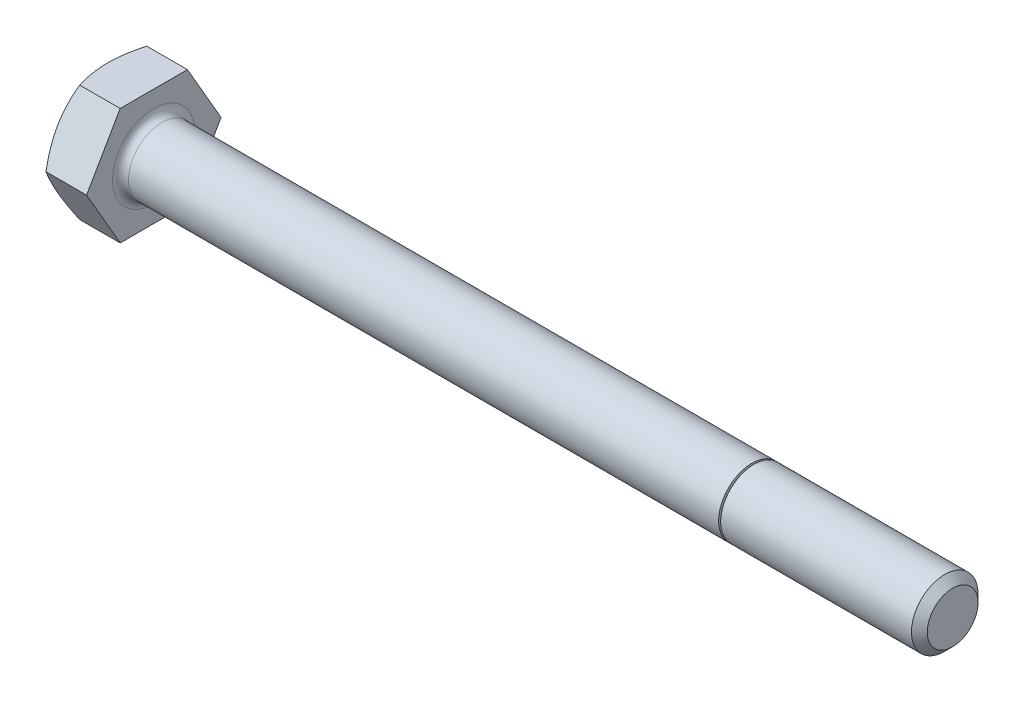
ISO-10303-21;
HEADER;
FILE_DESCRIPTION(('STEP AP214'),'2;1');
FILE_NAME('part.step','',(''),(''),'','','');
FILE_SCHEMA(('AUTOMOTIVE_DESIGN { 1 0 10303 214 1 1 1 1 }'));
ENDSEC;
DATA;
#1=APPLICATION_CONTEXT('core data for automotive mechanical design processes');
#2=APPLICATION_PROTOCOL_DEFINITION('international standard','automotive_design',2000,#1);
#3=PRODUCT_CONTEXT('',#1,'mechanical');
#4=PRODUCT('Part','Part','',(#3));
#5=PRODUCT_RELATED_PRODUCT_CATEGORY('part','',(#4));
#6=PRODUCT_DEFINITION_FORMATION('','',#4);
#7=PRODUCT_DEFINITION_CONTEXT('part definition',#1,'design');
#8=PRODUCT_DEFINITION('design','',#6,#7);
#9=PRODUCT_DEFINITION_SHAPE('','',#8);
#10=(LENGTH_UNIT() NAMED_UNIT(*) SI_UNIT(.MILLI.,.METRE.));
#11=(NAMED_UNIT(*) PLANE_ANGLE_UNIT() SI_UNIT($,.RADIAN.));
#12=(NAMED_UNIT(*) SI_UNIT($,.STERADIAN.) SOLID_ANGLE_UNIT());
#13=UNCERTAINTY_MEASURE_WITH_UNIT(LENGTH_MEASURE(1.E-05),#10,'distance_accuracy_value','');
#14=(GEOMETRIC_REPRESENTATION_CONTEXT(3) GLOBAL_UNCERTAINTY_ASSIGNED_CONTEXT((#13)) GLOBAL_UNIT_ASSIGNED_CONTEXT((#10,
#11,#12)) REPRESENTATION_CONTEXT('',''));
#15=CARTESIAN_POINT('',(0.,0.,0.));
#16=DIRECTION('',(0.,0.,1.));
#17=DIRECTION('',(1.,0.,0.));
#18=AXIS2_PLACEMENT_3D('',#15,#16,#17);
#19=CARTESIAN_POINT('',(-2.1828125,2.778125,-4.81185364977728));
#20=DIRECTION('',(0.,0.500000000000001,-0.866025403784438));
#21=DIRECTION('',(0.,0.866025403784438,0.500000000000001));
#22=AXIS2_PLACEMENT_3D('',#19,#20,#21);
#23=PLANE('',#22);
#24=CARTESIAN_POINT('',(-4.36562500004771,2.77812499999461,-4.81185364976793));
#25=CARTESIAN_POINT('',(-4.36564770823841,2.89604082120703,-4.74377491865721));
#26=CARTESIAN_POINT('',(-4.36273598289476,3.01395096201246,-4.67569946712628));
#27=CARTESIAN_POINT('',(-4.3512124439789,3.24953972538615,-4.53968223117683));
#28=CARTESIAN_POINT('',(-4.34260175884417,3.36721838916294,-4.47174042296655));
#29=CARTESIAN_POINT('',(-4.3199057801546,3.60158408770528,-4.33642932382367));
#30=CARTESIAN_POINT('',(-4.30584804700284,3.71827313957555,-4.26905886831512));
#31=CARTESIAN_POINT('',(-4.27256035949702,3.95109529630589,-4.13463893345372));
#32=CARTESIAN_POINT('',(-4.2533302690026,4.06722838645074,-4.06758946259672));
#33=CARTESIAN_POINT('',(-4.18847552960981,4.4143123329907,-3.86720045263038));
#34=CARTESIAN_POINT('',(-4.1356549211625,4.64425489751612,-3.7344430511035));
#35=CARTESIAN_POINT('',(-4.01383708794973,5.10216262148669,-3.47006990340515));
#36=CARTESIAN_POINT('',(-3.94475907436848,5.33011180869747,-3.33846337880748));
#37=CARTESIAN_POINT('',(-3.86936076655585,5.55625000000819,-3.20790243318012));
#38=B_SPLINE_CURVE_WITH_KNOTS('',3,(#24,#25,#26,#27,#28,#29,#30,#31,#32,#33,#34,#35,#36,#37),
.UNSPECIFIED.,.F.,.F.,(4,2,2,2,2,2,4),(0.,0.40843070134794,0.816780554488554,1.22309070766075,
1.62941155627177,2.44098829515902,3.25668653179872),.UNSPECIFIED.);
#39=CARTESIAN_POINT('',(-4.36562500005864,2.77812499999594,-4.81185364977023));
#40=VERTEX_POINT('',#39);
#41=CARTESIAN_POINT('',(-3.86936076655547,5.55625,-3.20790243318486));
#42=VERTEX_POINT('',#41);
#43=EDGE_CURVE('E199',#40,#42,#38,.T.);
#44=ORIENTED_EDGE('',*,*,#43,.T.);
#45=DIRECTION('',(-1.,0.,0.));
#46=VECTOR('',#45,1.);
#47=CARTESIAN_POINT('',(0.,5.55625,-3.20790243318486));
#48=LINE('',#47,#46);
#49=CARTESIAN_POINT('',(0.,5.55625,-3.20790243318486));
#50=VERTEX_POINT('',#49);
#51=EDGE_CURVE('E134',#50,#42,#48,.T.);
#52=ORIENTED_EDGE('',*,*,#51,.F.);
#53=DIRECTION('',(0.,0.866025403784438,0.500000000000001));
#54=VECTOR('',#53,1.);
#55=CARTESIAN_POINT('',(0.,5.55625,-3.20790243318486));
#56=LINE('',#55,#54);
#57=CARTESIAN_POINT('',(0.,0.,-6.41580486636972));
#58=VERTEX_POINT('',#57);
#59=EDGE_CURVE('E128',#58,#50,#56,.T.);
#60=ORIENTED_EDGE('',*,*,#59,.F.);
#61=DIRECTION('',(-1.,0.,0.));
#62=VECTOR('',#61,1.);
#63=CARTESIAN_POINT('',(0.,0.,-6.41580486636972));
#64=LINE('',#63,#62);
#65=CARTESIAN_POINT('',(-3.86936076655547,0.,-6.41580486636972));
#66=VERTEX_POINT('',#65);
#67=EDGE_CURVE('E132',#58,#66,#64,.T.);
#68=ORIENTED_EDGE('',*,*,#67,.T.);
#69=CARTESIAN_POINT('',(-3.86936076656085,6.80663266309856E-12,-6.41580486636578));
#70=CARTESIAN_POINT('',(-3.94475907437272,0.226138191316285,-6.2852439207392));
#71=CARTESIAN_POINT('',(-4.0138370879533,0.454087378525773,-6.15363739614225));
#72=CARTESIAN_POINT('',(-4.13565492116488,0.911995102493774,-5.88926424844531));
#73=CARTESIAN_POINT('',(-4.18847552961167,1.14193766701794,-5.75650684691913));
#74=CARTESIAN_POINT('',(-4.25333026900373,1.48902161355598,-5.55611783695399));
#75=CARTESIAN_POINT('',(-4.27256035949792,1.60515470370015,-5.48906836609744));
#76=CARTESIAN_POINT('',(-4.30584804700346,1.83797686042902,-5.35464843123671));
#77=CARTESIAN_POINT('',(-4.31990578015519,1.95466591229849,-5.28727797572839));
#78=CARTESIAN_POINT('',(-4.3426017588442,2.18903161083967,-5.15196687658683));
#79=CARTESIAN_POINT('',(-4.3512124439784,2.30671027461609,-5.08402506837764));
#80=CARTESIAN_POINT('',(-4.36273598289535,2.54229903798717,-4.94800783242729));
#81=CARTESIAN_POINT('',(-4.36564770824063,2.66020917879036,-4.87993238089438));
#82=CARTESIAN_POINT('',(-4.36562500005394,2.77812499999845,-4.81185364977818));
#83=B_SPLINE_CURVE_WITH_KNOTS('',3,(#69,#70,#71,#72,#73,#74,#75,#76,#77,#78,#79,#80,#81,#82),
.UNSPECIFIED.,.F.,.F.,(4,2,2,2,2,2,4),(0.,0.815698236634874,1.62727497551758,2.03359582412611,
2.43990597729587,2.84825583043386,3.25668653177905),.UNSPECIFIED.);
#84=EDGE_CURVE('E191',#66,#40,#83,.T.);
#85=ORIENTED_EDGE('',*,*,#84,.T.);
#86=EDGE_LOOP('',(#44,#52,#60,#68,#85));
#87=FACE_BOUND('',#86,.T.);
#88=ADVANCED_FACE('F44',(#87),#23,.T.);
#89=CARTESIAN_POINT('',(-2.1828125,5.55625,0.));
#90=DIRECTION('',(0.,1.,0.));
#91=DIRECTION('',(0.,0.,1.));
#92=AXIS2_PLACEMENT_3D('',#89,#90,#91);
#93=PLANE('',#92);
#94=CARTESIAN_POINT('',(-4.36562500004771,5.5562499999892,0.));
#95=CARTESIAN_POINT('',(-4.36564770823841,5.55624999999612,0.136157462233417));
#96=CARTESIAN_POINT('',(-4.36273598289476,5.55624999999896,0.272308365300187));
#97=CARTESIAN_POINT('',(-4.3512124439789,5.55625000000104,0.544342837202695));
#98=CARTESIAN_POINT('',(-4.34260175884417,5.55625000000028,0.680226453621941));
#99=CARTESIAN_POINT('',(-4.3199057801546,5.55624999999972,0.950848651906735));
#100=CARTESIAN_POINT('',(-4.30584804700284,5.55624999999992,1.08558956292418));
#101=CARTESIAN_POINT('',(-4.27256035949702,5.55625000000008,1.35442943264724));
#102=CARTESIAN_POINT('',(-4.25333026900259,5.55625000000003,1.48852837436116));
#103=CARTESIAN_POINT('',(-4.18847552960981,5.55624999999995,1.8893063942937));
#104=CARTESIAN_POINT('',(-4.1356549211625,5.55624999999997,2.1548211973475));
#105=CARTESIAN_POINT('',(-4.01383708794973,5.55625000000003,2.6835674927443));
#106=CARTESIAN_POINT('',(-3.94475907436847,5.55625000000006,2.94678054193969));
#107=CARTESIAN_POINT('',(-3.86936076655585,5.55625,3.20790243319432));
#108=B_SPLINE_CURVE_WITH_KNOTS('',3,(#94,#95,#96,#97,#98,#99,#100,#101,#102,#103,#104,#105,#106,
#107),.UNSPECIFIED.,.F.,.F.,(4,2,2,2,2,2,4),(0.,0.408430701347943,0.816780554488557,
1.22309070766075,1.62941155627177,2.44098829515903,3.25668653179873),.UNSPECIFIED.);
#109=CARTESIAN_POINT('',(-4.36562500005864,5.55624999999186,0.));
#110=VERTEX_POINT('',#109);
#111=CARTESIAN_POINT('',(-3.86936076655547,5.55625,3.20790243318486));
#112=VERTEX_POINT('',#111);
#113=EDGE_CURVE('E281',#110,#112,#108,.T.);
#114=ORIENTED_EDGE('',*,*,#113,.T.);
#115=DIRECTION('',(-1.,0.,0.));
#116=VECTOR('',#115,1.);
#117=CARTESIAN_POINT('',(0.,5.55625,3.20790243318486));
#118=LINE('',#117,#116);
#119=CARTESIAN_POINT('',(0.,5.55625,3.20790243318486));
#120=VERTEX_POINT('',#119);
#121=EDGE_CURVE('E157',#120,#112,#118,.T.);
#122=ORIENTED_EDGE('',*,*,#121,.F.);
#123=DIRECTION('',(0.,0.,1.));
#124=VECTOR('',#123,1.);
#125=CARTESIAN_POINT('',(0.,5.55625,3.20790243318486));
#126=LINE('',#125,#124);
#127=EDGE_CURVE('E137',#50,#120,#126,.T.);
#128=ORIENTED_EDGE('',*,*,#127,.F.);
#129=ORIENTED_EDGE('',*,*,#51,.T.);
#130=CARTESIAN_POINT('',(-3.86936076655096,5.55624999999254,-3.20790243319432));
#131=CARTESIAN_POINT('',(-3.94475907436655,5.55624999999739,-2.94678054194041));
#132=CARTESIAN_POINT('',(-4.01383708794902,5.55624999999932,-2.68356749274527));
#133=CARTESIAN_POINT('',(-4.13565492116273,5.55625000000068,-2.15482119734855));
#134=CARTESIAN_POINT('',(-4.18847552960976,5.55625000000012,-1.88930639429458));
#135=CARTESIAN_POINT('',(-4.25333026900241,5.55624999999994,-1.48852837436199));
#136=CARTESIAN_POINT('',(-4.27256035949684,5.55624999999998,-1.35442943264813));
#137=CARTESIAN_POINT('',(-4.30584804700278,5.55625000000002,-1.08558956292519));
#138=CARTESIAN_POINT('',(-4.31990578015466,5.55625000000001,-0.950848651907796));
#139=CARTESIAN_POINT('',(-4.34260175884392,5.55625,-0.680226453623121));
#140=CARTESIAN_POINT('',(-4.35121244397822,5.55625,-0.544342837203943));
#141=CARTESIAN_POINT('',(-4.36273598289532,5.55625,-0.272308365301647));
#142=CARTESIAN_POINT('',(-4.36564770824063,5.55625000000001,-0.136157462235023));
#143=CARTESIAN_POINT('',(-4.36562500005394,5.55625,-1.79905867845376E-12));
#144=B_SPLINE_CURVE_WITH_KNOTS('',3,(#130,#131,#132,#133,#134,#135,#136,#137,#138,#139,#140,
#141,#142,#143),.UNSPECIFIED.,.F.,.F.,(4,2,2,2,2,2,4),(0.,0.815698236639878,1.6272749755274,
2.03359582413824,2.43990597731029,2.84825583045067,3.25668653179829),.UNSPECIFIED.);
#145=EDGE_CURVE('E286',#42,#110,#144,.T.);
#146=ORIENTED_EDGE('',*,*,#145,.T.);
#147=EDGE_LOOP('',(#114,#122,#128,#129,#146));
#148=FACE_BOUND('',#147,.T.);
#149=ADVANCED_FACE('F274',(#148),#93,.T.);
#150=CARTESIAN_POINT('',(-2.1828125,2.778125,4.81185364977729));
#151=DIRECTION('',(0.,0.5,0.866025403784439));
#152=DIRECTION('',(0.,-0.866025403784439,0.5));
#153=AXIS2_PLACEMENT_3D('',#150,#151,#152);
#154=PLANE('',#153);
#155=CARTESIAN_POINT('',(-4.36562500004043,2.77812499999591,4.81185364977021));
#156=CARTESIAN_POINT('',(-4.36564770823016,2.66020917879034,4.87993238089101));
#157=CARTESIAN_POINT('',(-4.3627359828862,2.54229903798816,4.94800783242582));
#158=CARTESIAN_POINT('',(-4.35121244397039,2.30671027461777,5.08402506837758));
#159=CARTESIAN_POINT('',(-4.34260175883604,2.18903161084104,5.15196687658629));
#160=CARTESIAN_POINT('',(-4.31990578014722,1.95466591229961,5.28727797572751));
#161=CARTESIAN_POINT('',(-4.30584804699584,1.83797686043018,5.35464843123598));
#162=CARTESIAN_POINT('',(-4.27256035949097,1.60515470370129,5.48906836609685));
#163=CARTESIAN_POINT('',(-4.2533302689971,1.48902161355704,5.55611783695341));
#164=CARTESIAN_POINT('',(-4.18847552960617,1.14193766701885,5.75650684691857));
#165=CARTESIAN_POINT('',(-4.13565492116033,0.911995102494584,5.88926424844482));
#166=CARTESIAN_POINT('',(-4.01383708795086,0.454087378526282,6.15363739614198));
#167=CARTESIAN_POINT('',(-3.94475907437146,0.226138191316588,6.28524392073908));
#168=CARTESIAN_POINT('',(-3.8693607665608,6.81787258954983E-12,6.41580486636578));
#169=B_SPLINE_CURVE_WITH_KNOTS('',3,(#155,#156,#157,#158,#159,#160,#161,#162,#163,#164,#165,
#166,#167,#168),.UNSPECIFIED.,.F.,.F.,(4,2,2,2,2,2,4),(0.,0.408430701345346,0.816780554483402,
1.22309070765317,1.62941155626175,2.44098829514429,3.25668653177902),.UNSPECIFIED.);
#170=CARTESIAN_POINT('',(-4.36562500004985,2.77812499999593,4.81185364977024));
#171=VERTEX_POINT('',#170);
#172=CARTESIAN_POINT('',(-3.86936076655547,0.,6.41580486636972));
#173=VERTEX_POINT('',#172);
#174=EDGE_CURVE('E95',#171,#173,#169,.T.);
#175=ORIENTED_EDGE('',*,*,#174,.T.);
#176=DIRECTION('',(-1.,0.,0.));
#177=VECTOR('',#176,1.);
#178=CARTESIAN_POINT('',(0.,0.,6.41580486636972));
#179=LINE('',#178,#177);
#180=CARTESIAN_POINT('',(0.,0.,6.41580486636972));
#181=VERTEX_POINT('',#180);
#182=EDGE_CURVE('E598',#181,#173,#179,.T.);
#183=ORIENTED_EDGE('',*,*,#182,.F.);
#184=DIRECTION('',(0.,-0.866025403784439,0.5));
#185=VECTOR('',#184,1.);
#186=CARTESIAN_POINT('',(0.,0.,6.41580486636972));
#187=LINE('',#186,#185);
#188=EDGE_CURVE('E597',#120,#181,#187,.T.);
#189=ORIENTED_EDGE('',*,*,#188,.F.);
#190=ORIENTED_EDGE('',*,*,#121,.T.);
#191=CARTESIAN_POINT('',(-3.86936076655096,5.55625000000446,3.20790243317367));
#192=CARTESIAN_POINT('',(-3.94475907436654,5.33011180869678,3.33846337880482));
#193=CARTESIAN_POINT('',(-4.01383708794901,5.1021626214872,3.47006990340405));
#194=CARTESIAN_POINT('',(-4.13565492116272,4.64425489751744,3.73444305110357));
#195=CARTESIAN_POINT('',(-4.18847552960975,4.41431233299162,3.86720045263007));
#196=CARTESIAN_POINT('',(-4.2533302690024,4.0672283864515,4.06758946259619));
#197=CARTESIAN_POINT('',(-4.27256035949683,3.95109529630672,4.13463893345315));
#198=CARTESIAN_POINT('',(-4.30584804700276,3.71827313957658,4.26905886831464));
#199=CARTESIAN_POINT('',(-4.31990578015465,3.60158408770646,4.33642932382333));
#200=CARTESIAN_POINT('',(-4.34260175884391,3.36721838916395,4.47174042296565));
#201=CARTESIAN_POINT('',(-4.35121244397821,3.24953972538685,4.53968223117523));
#202=CARTESIAN_POINT('',(-4.36273598289531,3.0139509620144,4.67569946712638));
#203=CARTESIAN_POINT('',(-4.36564770824062,2.89604082121052,4.74377491865969));
#204=CARTESIAN_POINT('',(-4.36562500005394,2.77812500000173,4.81185364977629));
#205=B_SPLINE_CURVE_WITH_KNOTS('',3,(#191,#192,#193,#194,#195,#196,#197,#198,#199,#200,#201,
#202,#203,#204),.UNSPECIFIED.,.F.,.F.,(4,2,2,2,2,2,4),(0.,0.815698236639829,1.6272749755273,
2.03359582413812,2.43990597731014,2.8482558304505,3.25668653179809),.UNSPECIFIED.);
#206=EDGE_CURVE('E264',#112,#171,#205,.T.);
#207=ORIENTED_EDGE('',*,*,#206,.T.);
#208=EDGE_LOOP('',(#175,#183,#189,#190,#207));
#209=FACE_BOUND('',#208,.T.);
#210=ADVANCED_FACE('F270',(#209),#154,.T.);
#211=CARTESIAN_POINT('',(-2.1828125,-2.778125,4.81185364977729));
#212=DIRECTION('',(0.,-0.5,0.866025403784439));
#213=DIRECTION('',(0.,-0.866025403784439,-0.5));
#214=AXIS2_PLACEMENT_3D('',#211,#212,#213);
#215=PLANE('',#214);
#216=CARTESIAN_POINT('',(-4.36562500004702,-2.77812499999401,4.81185364976691));
#217=CARTESIAN_POINT('',(-4.36564770823816,-2.89604082120682,4.74377491865684));
#218=CARTESIAN_POINT('',(-4.36273598289469,-3.01395096201242,4.67569946712618));
#219=CARTESIAN_POINT('',(-4.35121244397896,-3.24953972538625,4.53968223117692));
#220=CARTESIAN_POINT('',(-4.34260175884419,-3.367218389163,4.47174042296656));
#221=CARTESIAN_POINT('',(-4.31990578015458,-3.60158408770531,4.33642932382363));
#222=CARTESIAN_POINT('',(-4.30584804700283,-3.71827313957559,4.2690588683151));
#223=CARTESIAN_POINT('',(-4.27256035949702,-3.95109529630594,4.13463893345372));
#224=CARTESIAN_POINT('',(-4.25333026900259,-4.06722838645078,4.06758946259671));
#225=CARTESIAN_POINT('',(-4.1884755296098,-4.41431233299073,3.86720045263037));
#226=CARTESIAN_POINT('',(-4.13565492116249,-4.64425489751615,3.7344430511035));
#227=CARTESIAN_POINT('',(-4.01383708794972,-5.1021626214867,3.47006990340516));
#228=CARTESIAN_POINT('',(-3.94475907436848,-5.33011180869749,3.33846337880749));
#229=CARTESIAN_POINT('',(-3.86936076655585,-5.55625000000819,3.20790243318013));
#230=B_SPLINE_CURVE_WITH_KNOTS('',3,(#216,#217,#218,#219,#220,#221,#222,#223,#224,#225,#226,
#227,#228,#229),.UNSPECIFIED.,.F.,.F.,(4,2,2,2,2,2,4),(0.,0.408430701347971,0.8167805544886,
1.22309070766079,1.62941155627182,2.44098829515903,3.25668653179871),.UNSPECIFIED.);
#231=CARTESIAN_POINT('',(-4.36562500005864,-2.77812499999593,4.81185364977024));
#232=VERTEX_POINT('',#231);
#233=CARTESIAN_POINT('',(-3.86936076655547,-5.55625,3.20790243318486));
#234=VERTEX_POINT('',#233);
#235=EDGE_CURVE('E87',#232,#234,#230,.T.);
#236=ORIENTED_EDGE('',*,*,#235,.T.);
#237=DIRECTION('',(-1.,0.,0.));
#238=VECTOR('',#237,1.);
#239=CARTESIAN_POINT('',(0.,-5.55625,3.20790243318486));
#240=LINE('',#239,#238);
#241=CARTESIAN_POINT('',(0.,-5.55625,3.20790243318486));
#242=VERTEX_POINT('',#241);
#243=EDGE_CURVE('E599',#242,#234,#240,.T.);
#244=ORIENTED_EDGE('',*,*,#243,.F.);
#245=DIRECTION('',(0.,-0.866025403784438,-0.5));
#246=VECTOR('',#245,1.);
#247=CARTESIAN_POINT('',(0.,-5.55625,3.20790243318486));
#248=LINE('',#247,#246);
#249=EDGE_CURVE('E607',#181,#242,#248,.T.);
#250=ORIENTED_EDGE('',*,*,#249,.F.);
#251=ORIENTED_EDGE('',*,*,#182,.T.);
#252=CARTESIAN_POINT('',(-3.8693607665608,-6.82033738445684E-12,6.41580486636578));
#253=CARTESIAN_POINT('',(-3.94475907437141,-0.226138191316505,6.28524392073908));
#254=CARTESIAN_POINT('',(-4.01383708795081,-0.454087378526144,6.15363739614204));
#255=CARTESIAN_POINT('',(-4.13565492116029,-0.911995102494381,5.88926424844497));
#256=CARTESIAN_POINT('',(-4.18847552960615,-1.14193766701863,5.75650684691874));
#257=CARTESIAN_POINT('',(-4.25333026899704,-1.48902161355673,5.55611783695357));
#258=CARTESIAN_POINT('',(-4.27256035949088,-1.6051547037009,5.48906836609701));
#259=CARTESIAN_POINT('',(-4.30584804699581,-1.83797686042976,5.35464843123629));
#260=CARTESIAN_POINT('',(-4.31990578014728,-1.95466591229921,5.28727797572798));
#261=CARTESIAN_POINT('',(-4.34260175883586,-2.18903161084032,5.15196687658646));
#262=CARTESIAN_POINT('',(-4.35121244396989,-2.30671027461669,5.0840250683773));
#263=CARTESIAN_POINT('',(-4.36273598288662,-2.54229903798766,4.94800783242702));
#264=CARTESIAN_POINT('',(-4.36564770823184,-2.66020917879079,4.87993238089414));
#265=CARTESIAN_POINT('',(-4.36562500004515,-2.77812499999882,4.81185364977797));
#266=B_SPLINE_CURVE_WITH_KNOTS('',3,(#252,#253,#254,#255,#256,#257,#258,#259,#260,#261,#262,
#263,#264,#265),.UNSPECIFIED.,.F.,.F.,(4,2,2,2,2,2,4),(0.,0.815698236634501,1.62727497551698,
2.03359582412537,2.43990597729499,2.84825583043278,3.25668653177776),.UNSPECIFIED.);
#267=EDGE_CURVE('E251',#173,#232,#266,.T.);
#268=ORIENTED_EDGE('',*,*,#267,.T.);
#269=EDGE_LOOP('',(#236,#244,#250,#251,#268));
#270=FACE_BOUND('',#269,.T.);
#271=ADVANCED_FACE('F273',(#270),#215,.T.);
#272=CARTESIAN_POINT('',(-2.1828125,-5.55625,0.));
#273=DIRECTION('',(0.,-1.,0.));
#274=DIRECTION('',(0.,0.,-1.));
#275=AXIS2_PLACEMENT_3D('',#272,#273,#274);
#276=PLANE('',#275);
#277=CARTESIAN_POINT('',(-4.36562500004771,-5.5562499999892,0.));
#278=CARTESIAN_POINT('',(-4.36564770823841,-5.55624999999612,-0.136157462233416));
#279=CARTESIAN_POINT('',(-4.36273598289476,-5.55624999999896,-0.272308365300186));
#280=CARTESIAN_POINT('',(-4.3512124439789,-5.55625000000104,-0.544342837202694));
#281=CARTESIAN_POINT('',(-4.34260175884417,-5.55625000000028,-0.68022645362194));
#282=CARTESIAN_POINT('',(-4.3199057801546,-5.55624999999972,-0.950848651906735));
#283=CARTESIAN_POINT('',(-4.30584804700284,-5.55624999999992,-1.08558956292418));
#284=CARTESIAN_POINT('',(-4.27256035949702,-5.55625000000008,-1.35442943264724));
#285=CARTESIAN_POINT('',(-4.25333026900259,-5.55625000000003,-1.48852837436116));
#286=CARTESIAN_POINT('',(-4.18847552960981,-5.55624999999994,-1.8893063942937));
#287=CARTESIAN_POINT('',(-4.1356549211625,-5.55624999999997,-2.1548211973475));
#288=CARTESIAN_POINT('',(-4.01383708794973,-5.55625000000003,-2.6835674927443));
#289=CARTESIAN_POINT('',(-3.94475907436847,-5.55625000000006,-2.94678054193969));
#290=CARTESIAN_POINT('',(-3.86936076655585,-5.55625,-3.20790243319432));
#291=B_SPLINE_CURVE_WITH_KNOTS('',3,(#277,#278,#279,#280,#281,#282,#283,#284,#285,#286,#287,
#288,#289,#290),.UNSPECIFIED.,.F.,.F.,(4,2,2,2,2,2,4),(0.,0.408430701347943,0.816780554488558,
1.22309070766075,1.62941155627177,2.44098829515903,3.25668653179873),.UNSPECIFIED.);
#292=CARTESIAN_POINT('',(-4.36562500005864,-5.55624999999186,0.));
#293=VERTEX_POINT('',#292);
#294=CARTESIAN_POINT('',(-3.86936076655547,-5.55625,-3.20790243318486));
#295=VERTEX_POINT('',#294);
#296=EDGE_CURVE('E225',#293,#295,#291,.T.);
#297=ORIENTED_EDGE('',*,*,#296,.T.);
#298=DIRECTION('',(-1.,0.,0.));
#299=VECTOR('',#298,1.);
#300=CARTESIAN_POINT('',(0.,-5.55625,-3.20790243318486));
#301=LINE('',#300,#299);
#302=CARTESIAN_POINT('',(0.,-5.55625,-3.20790243318486));
#303=VERTEX_POINT('',#302);
#304=EDGE_CURVE('E604',#303,#295,#301,.T.);
#305=ORIENTED_EDGE('',*,*,#304,.F.);
#306=DIRECTION('',(0.,0.,-1.));
#307=VECTOR('',#306,1.);
#308=CARTESIAN_POINT('',(0.,-5.55625,-3.20790243318486));
#309=LINE('',#308,#307);
#310=EDGE_CURVE('E143',#242,#303,#309,.T.);
#311=ORIENTED_EDGE('',*,*,#310,.F.);
#312=ORIENTED_EDGE('',*,*,#243,.T.);
#313=CARTESIAN_POINT('',(-3.86936076655096,-5.55624999999254,3.20790243319432));
#314=CARTESIAN_POINT('',(-3.94475907436655,-5.55624999999739,2.94678054194041));
#315=CARTESIAN_POINT('',(-4.01383708794902,-5.55624999999932,2.68356749274527));
#316=CARTESIAN_POINT('',(-4.13565492116273,-5.55625000000068,2.15482119734855));
#317=CARTESIAN_POINT('',(-4.18847552960976,-5.55625000000013,1.88930639429458));
#318=CARTESIAN_POINT('',(-4.25333026900241,-5.55624999999994,1.48852837436199));
#319=CARTESIAN_POINT('',(-4.27256035949684,-5.55624999999998,1.35442943264813));
#320=CARTESIAN_POINT('',(-4.30584804700278,-5.55625000000002,1.08558956292519));
#321=CARTESIAN_POINT('',(-4.31990578015466,-5.55625,0.950848651907798));
#322=CARTESIAN_POINT('',(-4.34260175884392,-5.55625,0.680226453623122));
#323=CARTESIAN_POINT('',(-4.35121244397822,-5.55625,0.544342837203944));
#324=CARTESIAN_POINT('',(-4.36273598289532,-5.55625,0.272308365301648));
#325=CARTESIAN_POINT('',(-4.36564770824063,-5.55625000000001,0.136157462235023));
#326=CARTESIAN_POINT('',(-4.36562500005394,-5.55625,1.7993839391055E-12));
#327=B_SPLINE_CURVE_WITH_KNOTS('',3,(#313,#314,#315,#316,#317,#318,#319,#320,#321,#322,#323,
#324,#325,#326),.UNSPECIFIED.,.F.,.F.,(4,2,2,2,2,2,4),(0.,0.815698236639879,1.6272749755274,
2.03359582413824,2.43990597731029,2.84825583045068,3.25668653179829),.UNSPECIFIED.);
#328=EDGE_CURVE('E217',#234,#293,#327,.T.);
#329=ORIENTED_EDGE('',*,*,#328,.T.);
#330=EDGE_LOOP('',(#297,#305,#311,#312,#329));
#331=FACE_BOUND('',#330,.T.);
#332=ADVANCED_FACE('F235',(#331),#276,.T.);
#333=CARTESIAN_POINT('',(-2.1828125,-2.778125,-4.81185364977729));
#334=DIRECTION('',(0.,-0.5,-0.866025403784439));
#335=DIRECTION('',(0.,0.866025403784439,-0.5));
#336=AXIS2_PLACEMENT_3D('',#333,#334,#335);
#337=PLANE('',#336);
#338=CARTESIAN_POINT('',(-4.36562500004771,-2.7781249999946,-4.81185364976794));
#339=CARTESIAN_POINT('',(-4.36564770823841,-2.66020917878976,-4.87993238089026));
#340=CARTESIAN_POINT('',(-4.36273598289479,-2.54229903798782,-4.94800783242573));
#341=CARTESIAN_POINT('',(-4.35121244397905,-2.30671027461751,-5.08402506837802));
#342=CARTESIAN_POINT('',(-4.34260175884443,-2.18903161084062,-5.15196687658661));
#343=CARTESIAN_POINT('',(-4.3199057801551,-1.95466591229901,-5.28727797572778));
#344=CARTESIAN_POINT('',(-4.30584804700349,-1.83797686042958,-5.35464843123631));
#345=CARTESIAN_POINT('',(-4.27256035949803,-1.60515470370066,-5.48906836609724));
#346=CARTESIAN_POINT('',(-4.25333026900381,-1.48902161355639,-5.5561178369538));
#347=CARTESIAN_POINT('',(-4.1884755296117,-1.14193766701822,-5.75650684691891));
#348=CARTESIAN_POINT('',(-4.13565492116493,-0.911995102494043,-5.88926424844513));
#349=CARTESIAN_POINT('',(-4.01383708795336,-0.454087378525958,-6.15363739614218));
#350=CARTESIAN_POINT('',(-3.94475907437277,-0.226138191316397,-6.28524392073921));
#351=CARTESIAN_POINT('',(-3.86936076656085,-6.80745778331117E-12,-6.41580486636579));
#352=B_SPLINE_CURVE_WITH_KNOTS('',3,(#338,#339,#340,#341,#342,#343,#344,#345,#346,#347,#348,
#349,#350,#351),.UNSPECIFIED.,.F.,.F.,(4,2,2,2,2,2,4),(0.,0.408430701345669,0.816780554484012,
1.22309070765396,1.62941155626274,2.44098829514552,3.2566865317807),.UNSPECIFIED.);
#353=CARTESIAN_POINT('',(-4.36562500005864,-2.77812499999593,-4.81185364977024));
#354=VERTEX_POINT('',#353);
#355=EDGE_CURVE('E152',#354,#66,#352,.T.);
#356=ORIENTED_EDGE('',*,*,#355,.T.);
#357=ORIENTED_EDGE('',*,*,#67,.F.);
#358=DIRECTION('',(0.,0.866025403784439,-0.5));
#359=VECTOR('',#358,1.);
#360=CARTESIAN_POINT('',(0.,0.,-6.41580486636972));
#361=LINE('',#360,#359);
#362=EDGE_CURVE('E138',#303,#58,#361,.T.);
#363=ORIENTED_EDGE('',*,*,#362,.F.);
#364=ORIENTED_EDGE('',*,*,#304,.T.);
#365=CARTESIAN_POINT('',(-3.86936076655096,-5.55625000000446,-3.20790243317367));
#366=CARTESIAN_POINT('',(-3.94475907436655,-5.33011180869677,-3.33846337880483));
#367=CARTESIAN_POINT('',(-4.01383708794902,-5.10216262148717,-3.47006990340407));
#368=CARTESIAN_POINT('',(-4.13565492116273,-4.64425489751739,-3.7344430511036));
#369=CARTESIAN_POINT('',(-4.18847552960976,-4.41431233299155,-3.86720045263011));
#370=CARTESIAN_POINT('',(-4.25333026900241,-4.0672283864514,-4.06758946259624));
#371=CARTESIAN_POINT('',(-4.27256035949684,-3.95109529630662,-4.13463893345321));
#372=CARTESIAN_POINT('',(-4.30584804700278,-3.71827313957647,-4.26905886831471));
#373=CARTESIAN_POINT('',(-4.31990578015466,-3.60158408770634,-4.3364293238234));
#374=CARTESIAN_POINT('',(-4.34260175884392,-3.36721838916382,-4.47174042296573));
#375=CARTESIAN_POINT('',(-4.35121244397822,-3.24953972538671,-4.53968223117532));
#376=CARTESIAN_POINT('',(-4.36273598289531,-3.01395096201424,-4.67569946712647));
#377=CARTESIAN_POINT('',(-4.36564770824062,-2.89604082121035,-4.74377491865978));
#378=CARTESIAN_POINT('',(-4.36562500005394,-2.77812500000156,-4.81185364977639));
#379=B_SPLINE_CURVE_WITH_KNOTS('',3,(#365,#366,#367,#368,#369,#370,#371,#372,#373,#374,#375,
#376,#377,#378),.UNSPECIFIED.,.F.,.F.,(4,2,2,2,2,2,4),(0.,0.815698236639879,1.6272749755274,
2.03359582413824,2.43990597731029,2.84825583045068,3.25668653179829),.UNSPECIFIED.);
#380=EDGE_CURVE('E169',#295,#354,#379,.T.);
#381=ORIENTED_EDGE('',*,*,#380,.T.);
#382=EDGE_LOOP('',(#356,#357,#363,#364,#381));
#383=FACE_BOUND('',#382,.T.);
#384=ADVANCED_FACE('F150',(#383),#337,.T.);
#385=CARTESIAN_POINT('',(-4.365625,0.,2.778125));
#386=DIRECTION('',(-1.,0.,0.));
#387=DIRECTION('',(0.,0.,1.));
#388=AXIS2_PLACEMENT_3D('',#385,#386,#387);
#389=PLANE('',#388);
#390=CARTESIAN_POINT('',(-4.36562500005455,0.,0.));
#391=DIRECTION('',(1.,0.,0.));
#392=DIRECTION('',(0.,0.,-1.));
#393=AXIS2_PLACEMENT_3D('',#390,#391,#392);
#394=CIRCLE('',#393,5.55624999998372);
#395=EDGE_CURVE('E490',#171,#232,#394,.T.);
#396=ORIENTED_EDGE('',*,*,#395,.F.);
#397=CARTESIAN_POINT('',(-4.36562500006334,0.,0.));
#398=DIRECTION('',(1.,0.,0.));
#399=DIRECTION('',(0.,0.,-1.));
#400=AXIS2_PLACEMENT_3D('',#397,#398,#399);
#401=CIRCLE('',#400,5.55624999998372);
#402=EDGE_CURVE('E76',#110,#171,#401,.T.);
#403=ORIENTED_EDGE('',*,*,#402,.F.);
#404=CARTESIAN_POINT('',(-4.36562500006334,0.,0.));
#405=DIRECTION('',(1.,0.,0.));
#406=DIRECTION('',(0.,0.,-1.));
#407=AXIS2_PLACEMENT_3D('',#404,#405,#406);
#408=CIRCLE('',#407,5.55624999998372);
#409=EDGE_CURVE('E153',#40,#110,#408,.T.);
#410=ORIENTED_EDGE('',*,*,#409,.F.);
#411=CARTESIAN_POINT('',(-4.36562500006334,0.,0.));
#412=DIRECTION('',(1.,0.,0.));
#413=DIRECTION('',(0.,0.,-1.));
#414=AXIS2_PLACEMENT_3D('',#411,#412,#413);
#415=CIRCLE('',#414,5.55624999998372);
#416=EDGE_CURVE('E61',#354,#40,#415,.T.);
#417=ORIENTED_EDGE('',*,*,#416,.F.);
#418=CARTESIAN_POINT('',(-4.36562500006334,0.,0.));
#419=DIRECTION('',(1.,0.,0.));
#420=DIRECTION('',(0.,0.,-1.));
#421=AXIS2_PLACEMENT_3D('',#418,#419,#420);
#422=CIRCLE('',#421,5.55624999998372);
#423=EDGE_CURVE('E499',#293,#354,#422,.T.);
#424=ORIENTED_EDGE('',*,*,#423,.F.);
#425=CARTESIAN_POINT('',(-4.36562500006334,0.,0.));
#426=DIRECTION('',(1.,0.,0.));
#427=DIRECTION('',(0.,0.,-1.));
#428=AXIS2_PLACEMENT_3D('',#425,#426,#427);
#429=CIRCLE('',#428,5.55624999998372);
#430=EDGE_CURVE('E495',#232,#293,#429,.T.);
#431=ORIENTED_EDGE('',*,*,#430,.F.);
#432=EDGE_LOOP('',(#396,#403,#410,#417,#424,#431));
#433=FACE_BOUND('',#432,.T.);
#434=ADVANCED_FACE('F296',(#433),#389,.T.);
#435=CARTESIAN_POINT('',(-3.86638318127552,0.,0.));
#436=DIRECTION('',(1.,0.,0.));
#437=DIRECTION('',(0.,0.,-1.));
#438=AXIS2_PLACEMENT_3D('',#435,#436,#437);
#439=CONICAL_SURFACE('',#438,6.4209621953637,1.04719755118477);
#440=ORIENTED_EDGE('',*,*,#409,.T.);
#441=ORIENTED_EDGE('',*,*,#145,.F.);
#442=ORIENTED_EDGE('',*,*,#43,.F.);
#443=EDGE_LOOP('',(#440,#441,#442));
#444=FACE_BOUND('',#443,.T.);
#445=ADVANCED_FACE('F293',(#444),#439,.T.);
#446=CARTESIAN_POINT('',(-3.86638318127552,0.,0.));
#447=DIRECTION('',(1.,0.,0.));
#448=DIRECTION('',(0.,0.,-1.));
#449=AXIS2_PLACEMENT_3D('',#446,#447,#448);
#450=CONICAL_SURFACE('',#449,6.4209621953637,1.04719755118477);
#451=ORIENTED_EDGE('',*,*,#113,.F.);
#452=ORIENTED_EDGE('',*,*,#402,.T.);
#453=ORIENTED_EDGE('',*,*,#206,.F.);
#454=EDGE_LOOP('',(#451,#452,#453));
#455=FACE_BOUND('',#454,.T.);
#456=ADVANCED_FACE('F247',(#455),#450,.T.);
#457=CARTESIAN_POINT('',(-3.86638318127552,0.,0.));
#458=DIRECTION('',(1.,0.,0.));
#459=DIRECTION('',(0.,0.,-1.));
#460=AXIS2_PLACEMENT_3D('',#457,#458,#459);
#461=CONICAL_SURFACE('',#460,6.4209621953637,1.0471975511924);
#462=ORIENTED_EDGE('',*,*,#395,.T.);
#463=ORIENTED_EDGE('',*,*,#267,.F.);
#464=ORIENTED_EDGE('',*,*,#174,.F.);
#465=EDGE_LOOP('',(#462,#463,#464));
#466=FACE_BOUND('',#465,.T.);
#467=ADVANCED_FACE('F241',(#466),#461,.T.);
#468=CARTESIAN_POINT('',(-3.86638318127552,0.,0.));
#469=DIRECTION('',(1.,0.,0.));
#470=DIRECTION('',(0.,0.,-1.));
#471=AXIS2_PLACEMENT_3D('',#468,#469,#470);
#472=CONICAL_SURFACE('',#471,6.4209621953637,1.04719755118477);
#473=ORIENTED_EDGE('',*,*,#235,.F.);
#474=ORIENTED_EDGE('',*,*,#430,.T.);
#475=ORIENTED_EDGE('',*,*,#328,.F.);
#476=EDGE_LOOP('',(#473,#474,#475));
#477=FACE_BOUND('',#476,.T.);
#478=ADVANCED_FACE('F237',(#477),#472,.T.);
#479=CARTESIAN_POINT('',(-3.86638318127552,0.,0.));
#480=DIRECTION('',(1.,0.,0.));
#481=DIRECTION('',(0.,0.,-1.));
#482=AXIS2_PLACEMENT_3D('',#479,#480,#481);
#483=CONICAL_SURFACE('',#482,6.4209621953637,1.04719755118477);
#484=ORIENTED_EDGE('',*,*,#296,.F.);
#485=ORIENTED_EDGE('',*,*,#423,.T.);
#486=ORIENTED_EDGE('',*,*,#380,.F.);
#487=EDGE_LOOP('',(#484,#485,#486));
#488=FACE_BOUND('',#487,.T.);
#489=ADVANCED_FACE('F184',(#488),#483,.T.);
#490=CARTESIAN_POINT('',(-3.86638318127552,0.,0.));
#491=DIRECTION('',(1.,0.,0.));
#492=DIRECTION('',(0.,0.,-1.));
#493=AXIS2_PLACEMENT_3D('',#490,#491,#492);
#494=CONICAL_SURFACE('',#493,6.4209621953637,1.04719755118477);
#495=ORIENTED_EDGE('',*,*,#355,.F.);
#496=ORIENTED_EDGE('',*,*,#416,.T.);
#497=ORIENTED_EDGE('',*,*,#84,.F.);
#498=EDGE_LOOP('',(#495,#496,#497));
#499=FACE_BOUND('',#498,.T.);
#500=ADVANCED_FACE('F180',(#499),#494,.T.);
#501=CARTESIAN_POINT('',(0.,0.,0.));
#502=DIRECTION('',(-1.,0.,0.));
#503=DIRECTION('',(0.,0.,1.));
#504=AXIS2_PLACEMENT_3D('',#501,#502,#503);
#505=PLANE('',#504);
#506=CARTESIAN_POINT('',(0.,0.,0.));
#507=DIRECTION('',(-1.,0.,0.));
#508=DIRECTION('',(0.,0.,1.));
#509=AXIS2_PLACEMENT_3D('',#506,#507,#508);
#510=CIRCLE('',#509,3.937);
#511=CARTESIAN_POINT('',(0.,0.,3.937));
#512=VERTEX_POINT('',#511);
#513=EDGE_CURVE('E13',#512,#512,#510,.T.);
#514=ORIENTED_EDGE('',*,*,#513,.T.);
#515=EDGE_LOOP('',(#514));
#516=FACE_BOUND('',#515,.T.);
#517=ORIENTED_EDGE('',*,*,#362,.T.);
#518=ORIENTED_EDGE('',*,*,#59,.T.);
#519=ORIENTED_EDGE('',*,*,#127,.T.);
#520=ORIENTED_EDGE('',*,*,#188,.T.);
#521=ORIENTED_EDGE('',*,*,#249,.T.);
#522=ORIENTED_EDGE('',*,*,#310,.T.);
#523=EDGE_LOOP('',(#517,#518,#519,#520,#521,#522));
#524=FACE_BOUND('',#523,.T.);
#525=ADVANCED_FACE('F141',(#516,#524),#505,.F.);
#526=CARTESIAN_POINT('',(0.,0.,0.));
#527=DIRECTION('',(1.,0.,0.));
#528=DIRECTION('',(0.,0.,-1.));
#529=AXIS2_PLACEMENT_3D('',#526,#527,#528);
#530=CYLINDRICAL_SURFACE('',#529,3.175);
#531=CARTESIAN_POINT('',(0.762,0.,0.));
#532=DIRECTION('',(-1.,0.,0.));
#533=DIRECTION('',(0.,0.,1.));
#534=AXIS2_PLACEMENT_3D('',#531,#532,#533);
#535=CIRCLE('',#534,3.175);
#536=CARTESIAN_POINT('',(0.761999999999999,0.,3.175));
#537=VERTEX_POINT('',#536);
#538=EDGE_CURVE('E53',#537,#537,#535,.F.);
#539=ORIENTED_EDGE('',*,*,#538,.T.);
#540=EDGE_LOOP('',(#539));
#541=FACE_BOUND('',#540,.T.);
#542=CARTESIAN_POINT('',(57.05554375,0.,0.));
#543=DIRECTION('',(1.,0.,0.));
#544=DIRECTION('',(0.,0.,-1.));
#545=AXIS2_PLACEMENT_3D('',#542,#543,#544);
#546=CIRCLE('',#545,3.175);
#547=CARTESIAN_POINT('',(57.05554375,0.,-3.175));
#548=VERTEX_POINT('',#547);
#549=EDGE_CURVE('E622',#548,#548,#546,.T.);
#550=ORIENTED_EDGE('',*,*,#549,.F.);
#551=EDGE_LOOP('',(#550));
#552=FACE_BOUND('',#551,.T.);
#553=ADVANCED_FACE('F304',(#541,#552),#530,.T.);
#554=CARTESIAN_POINT('',(76.1999999999164,0.,0.));
#555=DIRECTION('',(1.,0.,0.));
#556=DIRECTION('',(0.,0.,-1.));
#557=AXIS2_PLACEMENT_3D('',#554,#555,#556);
#558=PLANE('',#557);
#559=CARTESIAN_POINT('',(76.1999999999164,0.,0.));
#560=DIRECTION('',(1.,0.,0.));
#561=DIRECTION('',(0.,0.,-1.));
#562=AXIS2_PLACEMENT_3D('',#559,#560,#561);
#563=CIRCLE('',#562,2.4193500000836);
#564=CARTESIAN_POINT('',(76.1999999999164,0.,-2.4193500000836));
#565=VERTEX_POINT('',#564);
#566=EDGE_CURVE('E147',#565,#565,#563,.T.);
#567=ORIENTED_EDGE('',*,*,#566,.T.);
#568=EDGE_LOOP('',(#567));
#569=FACE_BOUND('',#568,.T.);
#570=ADVANCED_FACE('F384',(#569),#558,.T.);
#571=CARTESIAN_POINT('',(76.1999999999164,0.,0.));
#572=DIRECTION('',(-1.,0.,0.));
#573=DIRECTION('',(0.,0.,1.));
#574=AXIS2_PLACEMENT_3D('',#571,#572,#573);
#575=CONICAL_SURFACE('',#574,2.4193500000836,0.78539816339745);
#576=CARTESIAN_POINT('',(75.44435,0.,0.));
#577=DIRECTION('',(1.,0.,0.));
#578=DIRECTION('',(0.,0.,-1.));
#579=AXIS2_PLACEMENT_3D('',#576,#577,#578);
#580=CIRCLE('',#579,3.175);
#581=CARTESIAN_POINT('',(75.44435,0.,-3.175));
#582=VERTEX_POINT('',#581);
#583=EDGE_CURVE('E613',#582,#582,#580,.T.);
#584=ORIENTED_EDGE('',*,*,#583,.T.);
#585=EDGE_LOOP('',(#584));
#586=FACE_BOUND('',#585,.T.);
#587=ORIENTED_EDGE('',*,*,#566,.F.);
#588=EDGE_LOOP('',(#587));
#589=FACE_BOUND('',#588,.T.);
#590=ADVANCED_FACE('F390',(#586,#589),#575,.T.);
#591=CARTESIAN_POINT('',(0.,0.,0.));
#592=DIRECTION('',(1.,0.,0.));
#593=DIRECTION('',(0.,0.,-1.));
#594=AXIS2_PLACEMENT_3D('',#591,#592,#593);
#595=CYLINDRICAL_SURFACE('',#594,3.175);
#596=CARTESIAN_POINT('',(57.2444562499967,0.,0.));
#597=DIRECTION('',(1.,0.,0.));
#598=DIRECTION('',(0.,0.,-1.));
#599=AXIS2_PLACEMENT_3D('',#596,#597,#598);
#600=CIRCLE('',#599,3.175);
#601=CARTESIAN_POINT('',(57.2444562499967,0.,-3.175));
#602=VERTEX_POINT('',#601);
#603=EDGE_CURVE('E616',#602,#602,#600,.T.);
#604=ORIENTED_EDGE('',*,*,#603,.T.);
#605=EDGE_LOOP('',(#604));
#606=FACE_BOUND('',#605,.T.);
#607=ORIENTED_EDGE('',*,*,#583,.F.);
#608=EDGE_LOOP('',(#607));
#609=FACE_BOUND('',#608,.T.);
#610=ADVANCED_FACE('F403',(#606,#609),#595,.T.);
#611=CARTESIAN_POINT('',(57.2444562499967,0.,0.));
#612=DIRECTION('',(1.,0.,0.));
#613=DIRECTION('',(0.,0.,-1.));
#614=AXIS2_PLACEMENT_3D('',#611,#612,#613);
#615=CONICAL_SURFACE('',#614,3.175,1.44644133224833);
#616=CARTESIAN_POINT('',(57.15,0.,0.));
#617=DIRECTION('',(1.,0.,0.));
#618=DIRECTION('',(0.,0.,-1.));
#619=AXIS2_PLACEMENT_3D('',#616,#617,#618);
#620=CIRCLE('',#619,2.41935000002514);
#621=CARTESIAN_POINT('',(57.15,0.,-2.41935000002514));
#622=VERTEX_POINT('',#621);
#623=EDGE_CURVE('E619',#622,#622,#620,.T.);
#624=ORIENTED_EDGE('',*,*,#623,.T.);
#625=EDGE_LOOP('',(#624));
#626=FACE_BOUND('',#625,.T.);
#627=ORIENTED_EDGE('',*,*,#603,.F.);
#628=EDGE_LOOP('',(#627));
#629=FACE_BOUND('',#628,.T.);
#630=ADVANCED_FACE('F415',(#626,#629),#615,.T.);
#631=CARTESIAN_POINT('',(57.15,0.,0.));
#632=DIRECTION('',(-1.,0.,0.));
#633=DIRECTION('',(0.,0.,1.));
#634=AXIS2_PLACEMENT_3D('',#631,#632,#633);
#635=CONICAL_SURFACE('',#634,2.41935000002514,1.446441332244);
#636=ORIENTED_EDGE('',*,*,#549,.T.);
#637=EDGE_LOOP('',(#636));
#638=FACE_BOUND('',#637,.T.);
#639=ORIENTED_EDGE('',*,*,#623,.F.);
#640=EDGE_LOOP('',(#639));
#641=FACE_BOUND('',#640,.T.);
#642=ADVANCED_FACE('F425',(#638,#641),#635,.T.);
#643=CARTESIAN_POINT('',(0.761999999999999,0.,0.));
#644=DIRECTION('',(-1.,0.,0.));
#645=DIRECTION('',(0.,0.,1.));
#646=AXIS2_PLACEMENT_3D('',#643,#644,#645);
#647=TOROIDAL_SURFACE('',#646,3.937,0.762);
#648=ORIENTED_EDGE('',*,*,#513,.F.);
#649=EDGE_LOOP('',(#648));
#650=FACE_BOUND('',#649,.T.);
#651=ORIENTED_EDGE('',*,*,#538,.F.);
#652=EDGE_LOOP('',(#651));
#653=FACE_BOUND('',#652,.T.);
#654=ADVANCED_FACE('F46',(#650,#653),#647,.F.);
#655=CLOSED_SHELL('',(#88,#149,#210,#271,#332,#384,#434,#445,#456,#467,#478,#489,#500,#525,#553,
#570,#590,#610,#630,#642,#654));
#656=MANIFOLD_SOLID_BREP('B2',#655);
#657=ADVANCED_BREP_SHAPE_REPRESENTATION('',(#18,#656),#14);
#658=SHAPE_DEFINITION_REPRESENTATION(#9,#657);
ENDSEC;
END-ISO-10303-21;
